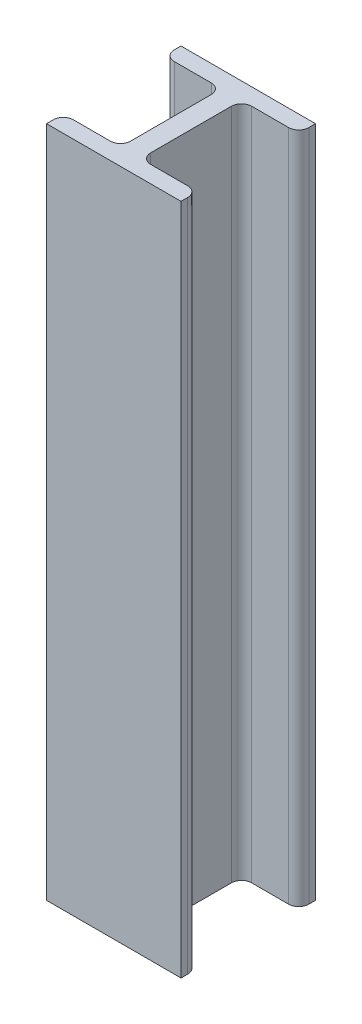
ISO-10303-21;
HEADER;
FILE_DESCRIPTION(('STEP AP214'),'2;1');
FILE_NAME('part.step','',(''),(''),'','','');
FILE_SCHEMA(('AUTOMOTIVE_DESIGN { 1 0 10303 214 1 1 1 1 }'));
ENDSEC;
DATA;
#1=APPLICATION_CONTEXT('core data for automotive mechanical design processes');
#2=APPLICATION_PROTOCOL_DEFINITION('international standard','automotive_design',2000,#1);
#3=PRODUCT_CONTEXT('',#1,'mechanical');
#4=PRODUCT('Part','Part','',(#3));
#5=PRODUCT_RELATED_PRODUCT_CATEGORY('part','',(#4));
#6=PRODUCT_DEFINITION_FORMATION('','',#4);
#7=PRODUCT_DEFINITION_CONTEXT('part definition',#1,'design');
#8=PRODUCT_DEFINITION('design','',#6,#7);
#9=PRODUCT_DEFINITION_SHAPE('','',#8);
#10=(LENGTH_UNIT() NAMED_UNIT(*) SI_UNIT(.MILLI.,.METRE.));
#11=(NAMED_UNIT(*) PLANE_ANGLE_UNIT() SI_UNIT($,.RADIAN.));
#12=(NAMED_UNIT(*) SI_UNIT($,.STERADIAN.) SOLID_ANGLE_UNIT());
#13=UNCERTAINTY_MEASURE_WITH_UNIT(LENGTH_MEASURE(1.E-05),#10,'distance_accuracy_value','');
#14=(GEOMETRIC_REPRESENTATION_CONTEXT(3) GLOBAL_UNCERTAINTY_ASSIGNED_CONTEXT((#13)) GLOBAL_UNIT_ASSIGNED_CONTEXT((#10,
#11,#12)) REPRESENTATION_CONTEXT('',''));
#15=CARTESIAN_POINT('',(0.,0.,0.));
#16=DIRECTION('',(0.,0.,1.));
#17=DIRECTION('',(1.,0.,0.));
#18=AXIS2_PLACEMENT_3D('',#15,#16,#17);
#19=CARTESIAN_POINT('',(-20.,200.,0.));
#20=DIRECTION('',(-1.,0.,0.));
#21=DIRECTION('',(0.,0.,1.));
#22=AXIS2_PLACEMENT_3D('',#19,#20,#21);
#23=PLANE('',#22);
#24=DIRECTION('',(0.,0.,-1.));
#25=VECTOR('',#24,1.);
#26=CARTESIAN_POINT('',(-20.,200.,0.));
#27=LINE('',#26,#25);
#28=CARTESIAN_POINT('',(-20.,200.,0.));
#29=VERTEX_POINT('',#28);
#30=CARTESIAN_POINT('',(-20.,200.,-2.));
#31=VERTEX_POINT('',#30);
#32=EDGE_CURVE('E179',#29,#31,#27,.T.);
#33=ORIENTED_EDGE('',*,*,#32,.T.);
#34=DIRECTION('',(0.,-1.,0.));
#35=VECTOR('',#34,1.);
#36=CARTESIAN_POINT('',(-20.,200.,-2.));
#37=LINE('',#36,#35);
#38=CARTESIAN_POINT('',(-20.,0.,-2.));
#39=VERTEX_POINT('',#38);
#40=EDGE_CURVE('E317',#31,#39,#37,.T.);
#41=ORIENTED_EDGE('',*,*,#40,.T.);
#42=DIRECTION('',(0.,0.,-1.));
#43=VECTOR('',#42,1.);
#44=CARTESIAN_POINT('',(-20.,0.,0.));
#45=LINE('',#44,#43);
#46=CARTESIAN_POINT('',(-20.,0.,0.));
#47=VERTEX_POINT('',#46);
#48=EDGE_CURVE('E182',#47,#39,#45,.T.);
#49=ORIENTED_EDGE('',*,*,#48,.F.);
#50=DIRECTION('',(0.,-1.,0.));
#51=VECTOR('',#50,1.);
#52=CARTESIAN_POINT('',(-20.,200.,0.));
#53=LINE('',#52,#51);
#54=EDGE_CURVE('E175',#29,#47,#53,.T.);
#55=ORIENTED_EDGE('',*,*,#54,.F.);
#56=EDGE_LOOP('',(#33,#41,#49,#55));
#57=FACE_BOUND('',#56,.T.);
#58=ADVANCED_FACE('F36',(#57),#23,.T.);
#59=CARTESIAN_POINT('',(0.,200.,0.));
#60=DIRECTION('',(0.,0.,-1.));
#61=DIRECTION('',(-1.,0.,0.));
#62=AXIS2_PLACEMENT_3D('',#59,#60,#61);
#63=PLANE('',#62);
#64=DIRECTION('',(1.,0.,0.));
#65=VECTOR('',#64,1.);
#66=CARTESIAN_POINT('',(0.,0.,0.));
#67=LINE('',#66,#65);
#68=CARTESIAN_POINT('',(20.,0.,0.));
#69=VERTEX_POINT('',#68);
#70=EDGE_CURVE('E229',#47,#69,#67,.T.);
#71=ORIENTED_EDGE('',*,*,#70,.T.);
#72=DIRECTION('',(0.,-1.,0.));
#73=VECTOR('',#72,1.);
#74=CARTESIAN_POINT('',(20.,200.,0.));
#75=LINE('',#74,#73);
#76=CARTESIAN_POINT('',(20.,200.,0.));
#77=VERTEX_POINT('',#76);
#78=EDGE_CURVE('E186',#77,#69,#75,.T.);
#79=ORIENTED_EDGE('',*,*,#78,.F.);
#80=DIRECTION('',(1.,0.,0.));
#81=VECTOR('',#80,1.);
#82=CARTESIAN_POINT('',(0.,200.,0.));
#83=LINE('',#82,#81);
#84=EDGE_CURVE('E189',#29,#77,#83,.T.);
#85=ORIENTED_EDGE('',*,*,#84,.F.);
#86=ORIENTED_EDGE('',*,*,#54,.T.);
#87=EDGE_LOOP('',(#71,#79,#85,#86));
#88=FACE_BOUND('',#87,.T.);
#89=ADVANCED_FACE('F190',(#88),#63,.F.);
#90=CARTESIAN_POINT('',(20.,200.,0.));
#91=DIRECTION('',(-1.,0.,0.));
#92=DIRECTION('',(0.,0.,1.));
#93=AXIS2_PLACEMENT_3D('',#90,#91,#92);
#94=PLANE('',#93);
#95=DIRECTION('',(0.,0.,-1.));
#96=VECTOR('',#95,1.);
#97=CARTESIAN_POINT('',(20.,0.,0.));
#98=LINE('',#97,#96);
#99=CARTESIAN_POINT('',(20.,0.,-2.));
#100=VERTEX_POINT('',#99);
#101=EDGE_CURVE('E231',#69,#100,#98,.T.);
#102=ORIENTED_EDGE('',*,*,#101,.T.);
#103=DIRECTION('',(0.,-1.,0.));
#104=VECTOR('',#103,1.);
#105=CARTESIAN_POINT('',(20.,200.,-2.));
#106=LINE('',#105,#104);
#107=CARTESIAN_POINT('',(20.,200.,-2.));
#108=VERTEX_POINT('',#107);
#109=EDGE_CURVE('E309',#100,#108,#106,.F.);
#110=ORIENTED_EDGE('',*,*,#109,.T.);
#111=DIRECTION('',(0.,0.,-1.));
#112=VECTOR('',#111,1.);
#113=CARTESIAN_POINT('',(20.,200.,0.));
#114=LINE('',#113,#112);
#115=EDGE_CURVE('E194',#77,#108,#114,.T.);
#116=ORIENTED_EDGE('',*,*,#115,.F.);
#117=ORIENTED_EDGE('',*,*,#78,.T.);
#118=EDGE_LOOP('',(#102,#110,#116,#117));
#119=FACE_BOUND('',#118,.T.);
#120=ADVANCED_FACE('F371',(#119),#94,.F.);
#121=CARTESIAN_POINT('',(0.,200.,-5.));
#122=DIRECTION('',(0.,0.,1.));
#123=DIRECTION('',(1.,0.,0.));
#124=AXIS2_PLACEMENT_3D('',#121,#122,#123);
#125=PLANE('',#124);
#126=DIRECTION('',(-1.,0.,0.));
#127=VECTOR('',#126,1.);
#128=CARTESIAN_POINT('',(0.,200.,-5.));
#129=LINE('',#128,#127);
#130=CARTESIAN_POINT('',(17.,200.,-5.));
#131=VERTEX_POINT('',#130);
#132=CARTESIAN_POINT('',(6.,200.,-5.));
#133=VERTEX_POINT('',#132);
#134=EDGE_CURVE('E205',#131,#133,#129,.T.);
#135=ORIENTED_EDGE('',*,*,#134,.F.);
#136=DIRECTION('',(0.,-1.,0.));
#137=VECTOR('',#136,1.);
#138=CARTESIAN_POINT('',(17.,200.,-5.));
#139=LINE('',#138,#137);
#140=CARTESIAN_POINT('',(17.,0.,-5.));
#141=VERTEX_POINT('',#140);
#142=EDGE_CURVE('E298',#131,#141,#139,.T.);
#143=ORIENTED_EDGE('',*,*,#142,.T.);
#144=DIRECTION('',(-1.,0.,0.));
#145=VECTOR('',#144,1.);
#146=CARTESIAN_POINT('',(0.,0.,-5.));
#147=LINE('',#146,#145);
#148=CARTESIAN_POINT('',(6.,0.,-5.));
#149=VERTEX_POINT('',#148);
#150=EDGE_CURVE('E234',#141,#149,#147,.T.);
#151=ORIENTED_EDGE('',*,*,#150,.T.);
#152=DIRECTION('',(0.,-1.,0.));
#153=VECTOR('',#152,1.);
#154=CARTESIAN_POINT('',(6.,200.,-5.));
#155=LINE('',#154,#153);
#156=EDGE_CURVE('E277',#149,#133,#155,.F.);
#157=ORIENTED_EDGE('',*,*,#156,.T.);
#158=EDGE_LOOP('',(#135,#143,#151,#157));
#159=FACE_BOUND('',#158,.T.);
#160=ADVANCED_FACE('F364',(#159),#125,.F.);
#161=CARTESIAN_POINT('',(3.,200.,0.));
#162=DIRECTION('',(-1.,0.,0.));
#163=DIRECTION('',(0.,0.,1.));
#164=AXIS2_PLACEMENT_3D('',#161,#162,#163);
#165=PLANE('',#164);
#166=DIRECTION('',(0.,0.,-1.));
#167=VECTOR('',#166,1.);
#168=CARTESIAN_POINT('',(3.,0.,0.));
#169=LINE('',#168,#167);
#170=CARTESIAN_POINT('',(3.,0.,-8.));
#171=VERTEX_POINT('',#170);
#172=CARTESIAN_POINT('',(3.,0.,-32.));
#173=VERTEX_POINT('',#172);
#174=EDGE_CURVE('E236',#171,#173,#169,.T.);
#175=ORIENTED_EDGE('',*,*,#174,.T.);
#176=DIRECTION('',(0.,-1.,0.));
#177=VECTOR('',#176,1.);
#178=CARTESIAN_POINT('',(3.,200.,-32.));
#179=LINE('',#178,#177);
#180=CARTESIAN_POINT('',(3.,200.,-32.));
#181=VERTEX_POINT('',#180);
#182=EDGE_CURVE('E275',#173,#181,#179,.F.);
#183=ORIENTED_EDGE('',*,*,#182,.T.);
#184=DIRECTION('',(0.,0.,-1.));
#185=VECTOR('',#184,1.);
#186=CARTESIAN_POINT('',(3.,200.,0.));
#187=LINE('',#186,#185);
#188=CARTESIAN_POINT('',(3.,200.,-8.));
#189=VERTEX_POINT('',#188);
#190=EDGE_CURVE('E207',#189,#181,#187,.T.);
#191=ORIENTED_EDGE('',*,*,#190,.F.);
#192=DIRECTION('',(0.,-1.,0.));
#193=VECTOR('',#192,1.);
#194=CARTESIAN_POINT('',(3.,0.,-8.));
#195=LINE('',#194,#193);
#196=EDGE_CURVE('E272',#189,#171,#195,.T.);
#197=ORIENTED_EDGE('',*,*,#196,.T.);
#198=EDGE_LOOP('',(#175,#183,#191,#197));
#199=FACE_BOUND('',#198,.T.);
#200=ADVANCED_FACE('F352',(#199),#165,.F.);
#201=CARTESIAN_POINT('',(0.,200.,-35.));
#202=DIRECTION('',(0.,0.,-1.));
#203=DIRECTION('',(-1.,0.,0.));
#204=AXIS2_PLACEMENT_3D('',#201,#202,#203);
#205=PLANE('',#204);
#206=DIRECTION('',(1.,0.,0.));
#207=VECTOR('',#206,1.);
#208=CARTESIAN_POINT('',(0.,0.,-35.));
#209=LINE('',#208,#207);
#210=CARTESIAN_POINT('',(6.,0.,-35.));
#211=VERTEX_POINT('',#210);
#212=CARTESIAN_POINT('',(17.,0.,-35.));
#213=VERTEX_POINT('',#212);
#214=EDGE_CURVE('E239',#211,#213,#209,.T.);
#215=ORIENTED_EDGE('',*,*,#214,.T.);
#216=DIRECTION('',(0.,-1.,0.));
#217=VECTOR('',#216,1.);
#218=CARTESIAN_POINT('',(17.,200.,-35.));
#219=LINE('',#218,#217);
#220=CARTESIAN_POINT('',(17.,200.,-35.));
#221=VERTEX_POINT('',#220);
#222=EDGE_CURVE('E11',#213,#221,#219,.F.);
#223=ORIENTED_EDGE('',*,*,#222,.T.);
#224=DIRECTION('',(1.,0.,0.));
#225=VECTOR('',#224,1.);
#226=CARTESIAN_POINT('',(0.,200.,-35.));
#227=LINE('',#226,#225);
#228=CARTESIAN_POINT('',(6.,200.,-35.));
#229=VERTEX_POINT('',#228);
#230=EDGE_CURVE('E210',#229,#221,#227,.T.);
#231=ORIENTED_EDGE('',*,*,#230,.F.);
#232=DIRECTION('',(0.,-1.,0.));
#233=VECTOR('',#232,1.);
#234=CARTESIAN_POINT('',(6.,0.,-35.));
#235=LINE('',#234,#233);
#236=EDGE_CURVE('E269',#229,#211,#235,.T.);
#237=ORIENTED_EDGE('',*,*,#236,.T.);
#238=EDGE_LOOP('',(#215,#223,#231,#237));
#239=FACE_BOUND('',#238,.T.);
#240=ADVANCED_FACE('F346',(#239),#205,.F.);
#241=CARTESIAN_POINT('',(20.,200.,0.));
#242=DIRECTION('',(-1.,0.,0.));
#243=DIRECTION('',(0.,0.,1.));
#244=AXIS2_PLACEMENT_3D('',#241,#242,#243);
#245=PLANE('',#244);
#246=DIRECTION('',(0.,0.,-1.));
#247=VECTOR('',#246,1.);
#248=CARTESIAN_POINT('',(20.,200.,0.));
#249=LINE('',#248,#247);
#250=CARTESIAN_POINT('',(20.,200.,-38.));
#251=VERTEX_POINT('',#250);
#252=CARTESIAN_POINT('',(20.,200.,-40.));
#253=VERTEX_POINT('',#252);
#254=EDGE_CURVE('E213',#251,#253,#249,.T.);
#255=ORIENTED_EDGE('',*,*,#254,.F.);
#256=DIRECTION('',(0.,-1.,0.));
#257=VECTOR('',#256,1.);
#258=CARTESIAN_POINT('',(20.,200.,-38.));
#259=LINE('',#258,#257);
#260=CARTESIAN_POINT('',(20.,0.,-38.));
#261=VERTEX_POINT('',#260);
#262=EDGE_CURVE('E44',#251,#261,#259,.T.);
#263=ORIENTED_EDGE('',*,*,#262,.T.);
#264=DIRECTION('',(0.,0.,-1.));
#265=VECTOR('',#264,1.);
#266=CARTESIAN_POINT('',(20.,0.,0.));
#267=LINE('',#266,#265);
#268=CARTESIAN_POINT('',(20.,0.,-40.));
#269=VERTEX_POINT('',#268);
#270=EDGE_CURVE('E242',#261,#269,#267,.T.);
#271=ORIENTED_EDGE('',*,*,#270,.T.);
#272=DIRECTION('',(0.,-1.,0.));
#273=VECTOR('',#272,1.);
#274=CARTESIAN_POINT('',(20.,200.,-40.));
#275=LINE('',#274,#273);
#276=EDGE_CURVE('E256',#253,#269,#275,.T.);
#277=ORIENTED_EDGE('',*,*,#276,.F.);
#278=EDGE_LOOP('',(#255,#263,#271,#277));
#279=FACE_BOUND('',#278,.T.);
#280=ADVANCED_FACE('F329',(#279),#245,.F.);
#281=CARTESIAN_POINT('',(0.,200.,-40.));
#282=DIRECTION('',(0.,0.,1.));
#283=DIRECTION('',(1.,0.,0.));
#284=AXIS2_PLACEMENT_3D('',#281,#282,#283);
#285=PLANE('',#284);
#286=DIRECTION('',(-1.,0.,0.));
#287=VECTOR('',#286,1.);
#288=CARTESIAN_POINT('',(0.,0.,-40.));
#289=LINE('',#288,#287);
#290=CARTESIAN_POINT('',(-20.,0.,-40.));
#291=VERTEX_POINT('',#290);
#292=EDGE_CURVE('E244',#269,#291,#289,.T.);
#293=ORIENTED_EDGE('',*,*,#292,.T.);
#294=DIRECTION('',(0.,-1.,0.));
#295=VECTOR('',#294,1.);
#296=CARTESIAN_POINT('',(-20.,200.,-40.));
#297=LINE('',#296,#295);
#298=CARTESIAN_POINT('',(-20.,200.,-40.));
#299=VERTEX_POINT('',#298);
#300=EDGE_CURVE('E227',#299,#291,#297,.T.);
#301=ORIENTED_EDGE('',*,*,#300,.F.);
#302=DIRECTION('',(-1.,0.,0.));
#303=VECTOR('',#302,1.);
#304=CARTESIAN_POINT('',(0.,200.,-40.));
#305=LINE('',#304,#303);
#306=EDGE_CURVE('E215',#253,#299,#305,.T.);
#307=ORIENTED_EDGE('',*,*,#306,.F.);
#308=ORIENTED_EDGE('',*,*,#276,.T.);
#309=EDGE_LOOP('',(#293,#301,#307,#308));
#310=FACE_BOUND('',#309,.T.);
#311=ADVANCED_FACE('F341',(#310),#285,.F.);
#312=CARTESIAN_POINT('',(-19.9999999999999,200.,0.));
#313=DIRECTION('',(-1.,0.,0.));
#314=DIRECTION('',(0.,0.,1.));
#315=AXIS2_PLACEMENT_3D('',#312,#313,#314);
#316=PLANE('',#315);
#317=DIRECTION('',(0.,0.,-1.));
#318=VECTOR('',#317,1.);
#319=CARTESIAN_POINT('',(-19.9999999999999,0.,0.));
#320=LINE('',#319,#318);
#321=CARTESIAN_POINT('',(-20.,0.,-38.));
#322=VERTEX_POINT('',#321);
#323=EDGE_CURVE('E247',#322,#291,#320,.T.);
#324=ORIENTED_EDGE('',*,*,#323,.F.);
#325=DIRECTION('',(0.,-1.,0.));
#326=VECTOR('',#325,1.);
#327=CARTESIAN_POINT('',(-20.,200.,-38.));
#328=LINE('',#327,#326);
#329=CARTESIAN_POINT('',(-20.,200.,-38.));
#330=VERTEX_POINT('',#329);
#331=EDGE_CURVE('E323',#322,#330,#328,.F.);
#332=ORIENTED_EDGE('',*,*,#331,.T.);
#333=DIRECTION('',(0.,0.,-1.));
#334=VECTOR('',#333,1.);
#335=CARTESIAN_POINT('',(-19.9999999999999,200.,0.));
#336=LINE('',#335,#334);
#337=EDGE_CURVE('E218',#330,#299,#336,.T.);
#338=ORIENTED_EDGE('',*,*,#337,.T.);
#339=ORIENTED_EDGE('',*,*,#300,.T.);
#340=EDGE_LOOP('',(#324,#332,#338,#339));
#341=FACE_BOUND('',#340,.T.);
#342=ADVANCED_FACE('F470',(#341),#316,.T.);
#343=CARTESIAN_POINT('',(0.,200.,-35.));
#344=DIRECTION('',(0.,0.,1.));
#345=DIRECTION('',(1.,0.,0.));
#346=AXIS2_PLACEMENT_3D('',#343,#344,#345);
#347=PLANE('',#346);
#348=DIRECTION('',(-1.,0.,0.));
#349=VECTOR('',#348,1.);
#350=CARTESIAN_POINT('',(0.,200.,-35.));
#351=LINE('',#350,#349);
#352=CARTESIAN_POINT('',(-6.,200.,-35.));
#353=VERTEX_POINT('',#352);
#354=CARTESIAN_POINT('',(-17.,200.,-35.));
#355=VERTEX_POINT('',#354);
#356=EDGE_CURVE('E220',#353,#355,#351,.T.);
#357=ORIENTED_EDGE('',*,*,#356,.T.);
#358=DIRECTION('',(0.,-1.,0.));
#359=VECTOR('',#358,1.);
#360=CARTESIAN_POINT('',(-17.,200.,-35.));
#361=LINE('',#360,#359);
#362=CARTESIAN_POINT('',(-17.,0.,-35.));
#363=VERTEX_POINT('',#362);
#364=EDGE_CURVE('E320',#355,#363,#361,.T.);
#365=ORIENTED_EDGE('',*,*,#364,.T.);
#366=DIRECTION('',(-1.,0.,0.));
#367=VECTOR('',#366,1.);
#368=CARTESIAN_POINT('',(0.,0.,-35.));
#369=LINE('',#368,#367);
#370=CARTESIAN_POINT('',(-6.,0.,-35.));
#371=VERTEX_POINT('',#370);
#372=EDGE_CURVE('E249',#371,#363,#369,.T.);
#373=ORIENTED_EDGE('',*,*,#372,.F.);
#374=DIRECTION('',(0.,-1.,0.));
#375=VECTOR('',#374,1.);
#376=CARTESIAN_POINT('',(-6.,200.,-35.));
#377=LINE('',#376,#375);
#378=EDGE_CURVE('E267',#371,#353,#377,.F.);
#379=ORIENTED_EDGE('',*,*,#378,.T.);
#380=EDGE_LOOP('',(#357,#365,#373,#379));
#381=FACE_BOUND('',#380,.T.);
#382=ADVANCED_FACE('F465',(#381),#347,.T.);
#383=CARTESIAN_POINT('',(-2.99999999999999,200.,0.));
#384=DIRECTION('',(-1.,0.,0.));
#385=DIRECTION('',(0.,0.,1.));
#386=AXIS2_PLACEMENT_3D('',#383,#384,#385);
#387=PLANE('',#386);
#388=DIRECTION('',(0.,0.,-1.));
#389=VECTOR('',#388,1.);
#390=CARTESIAN_POINT('',(-2.99999999999999,0.,0.));
#391=LINE('',#390,#389);
#392=CARTESIAN_POINT('',(-2.99999999999999,0.,-8.));
#393=VERTEX_POINT('',#392);
#394=CARTESIAN_POINT('',(-3.,0.,-32.));
#395=VERTEX_POINT('',#394);
#396=EDGE_CURVE('E201',#393,#395,#391,.T.);
#397=ORIENTED_EDGE('',*,*,#396,.F.);
#398=DIRECTION('',(0.,-1.,0.));
#399=VECTOR('',#398,1.);
#400=CARTESIAN_POINT('',(-2.99999999999999,200.,-8.));
#401=LINE('',#400,#399);
#402=CARTESIAN_POINT('',(-2.99999999999999,200.,-8.));
#403=VERTEX_POINT('',#402);
#404=EDGE_CURVE('E265',#393,#403,#401,.F.);
#405=ORIENTED_EDGE('',*,*,#404,.T.);
#406=DIRECTION('',(0.,0.,-1.));
#407=VECTOR('',#406,1.);
#408=CARTESIAN_POINT('',(-2.99999999999999,200.,0.));
#409=LINE('',#408,#407);
#410=CARTESIAN_POINT('',(-3.,200.,-32.));
#411=VERTEX_POINT('',#410);
#412=EDGE_CURVE('E222',#403,#411,#409,.T.);
#413=ORIENTED_EDGE('',*,*,#412,.T.);
#414=DIRECTION('',(0.,-1.,0.));
#415=VECTOR('',#414,1.);
#416=CARTESIAN_POINT('',(-3.,0.,-32.));
#417=LINE('',#416,#415);
#418=EDGE_CURVE('E262',#411,#395,#417,.T.);
#419=ORIENTED_EDGE('',*,*,#418,.T.);
#420=EDGE_LOOP('',(#397,#405,#413,#419));
#421=FACE_BOUND('',#420,.T.);
#422=ADVANCED_FACE('F458',(#421),#387,.T.);
#423=CARTESIAN_POINT('',(0.,200.,-5.));
#424=DIRECTION('',(0.,0.,-1.));
#425=DIRECTION('',(-1.,0.,0.));
#426=AXIS2_PLACEMENT_3D('',#423,#424,#425);
#427=PLANE('',#426);
#428=DIRECTION('',(1.,0.,0.));
#429=VECTOR('',#428,1.);
#430=CARTESIAN_POINT('',(0.,0.,-5.));
#431=LINE('',#430,#429);
#432=CARTESIAN_POINT('',(-17.,0.,-5.));
#433=VERTEX_POINT('',#432);
#434=CARTESIAN_POINT('',(-5.99999999999999,0.,-5.));
#435=VERTEX_POINT('',#434);
#436=EDGE_CURVE('E199',#433,#435,#431,.T.);
#437=ORIENTED_EDGE('',*,*,#436,.F.);
#438=DIRECTION('',(0.,-1.,0.));
#439=VECTOR('',#438,1.);
#440=CARTESIAN_POINT('',(-17.,200.,-5.));
#441=LINE('',#440,#439);
#442=CARTESIAN_POINT('',(-17.,200.,-5.));
#443=VERTEX_POINT('',#442);
#444=EDGE_CURVE('E51',#433,#443,#441,.F.);
#445=ORIENTED_EDGE('',*,*,#444,.T.);
#446=DIRECTION('',(1.,0.,0.));
#447=VECTOR('',#446,1.);
#448=CARTESIAN_POINT('',(0.,200.,-5.));
#449=LINE('',#448,#447);
#450=CARTESIAN_POINT('',(-5.99999999999999,200.,-5.));
#451=VERTEX_POINT('',#450);
#452=EDGE_CURVE('E225',#443,#451,#449,.T.);
#453=ORIENTED_EDGE('',*,*,#452,.T.);
#454=DIRECTION('',(0.,-1.,0.));
#455=VECTOR('',#454,1.);
#456=CARTESIAN_POINT('',(-5.99999999999999,0.,-5.));
#457=LINE('',#456,#455);
#458=EDGE_CURVE('E185',#451,#435,#457,.T.);
#459=ORIENTED_EDGE('',*,*,#458,.T.);
#460=EDGE_LOOP('',(#437,#445,#453,#459));
#461=FACE_BOUND('',#460,.T.);
#462=ADVANCED_FACE('F374',(#461),#427,.T.);
#463=CARTESIAN_POINT('',(0.,200.,0.));
#464=DIRECTION('',(0.,1.,0.));
#465=DIRECTION('',(0.,0.,1.));
#466=AXIS2_PLACEMENT_3D('',#463,#464,#465);
#467=PLANE('',#466);
#468=ORIENTED_EDGE('',*,*,#115,.T.);
#469=CARTESIAN_POINT('',(17.,200.,-2.));
#470=DIRECTION('',(0.,1.,0.));
#471=DIRECTION('',(0.,0.,1.));
#472=AXIS2_PLACEMENT_3D('',#469,#470,#471);
#473=CIRCLE('',#472,3.);
#474=EDGE_CURVE('E315',#108,#131,#473,.T.);
#475=ORIENTED_EDGE('',*,*,#474,.T.);
#476=ORIENTED_EDGE('',*,*,#134,.T.);
#477=CARTESIAN_POINT('',(6.,200.,-8.));
#478=DIRECTION('',(0.,1.,0.));
#479=DIRECTION('',(0.,0.,1.));
#480=AXIS2_PLACEMENT_3D('',#477,#478,#479);
#481=CIRCLE('',#480,3.);
#482=EDGE_CURVE('E296',#133,#189,#481,.F.);
#483=ORIENTED_EDGE('',*,*,#482,.T.);
#484=ORIENTED_EDGE('',*,*,#190,.T.);
#485=CARTESIAN_POINT('',(6.,200.,-32.));
#486=DIRECTION('',(0.,1.,0.));
#487=DIRECTION('',(0.,0.,1.));
#488=AXIS2_PLACEMENT_3D('',#485,#486,#487);
#489=CIRCLE('',#488,3.);
#490=EDGE_CURVE('E291',#181,#229,#489,.F.);
#491=ORIENTED_EDGE('',*,*,#490,.T.);
#492=ORIENTED_EDGE('',*,*,#230,.T.);
#493=CARTESIAN_POINT('',(17.,200.,-38.));
#494=DIRECTION('',(0.,1.,0.));
#495=DIRECTION('',(0.,0.,1.));
#496=AXIS2_PLACEMENT_3D('',#493,#494,#495);
#497=CIRCLE('',#496,3.);
#498=EDGE_CURVE('E311',#221,#251,#497,.T.);
#499=ORIENTED_EDGE('',*,*,#498,.T.);
#500=ORIENTED_EDGE('',*,*,#254,.T.);
#501=ORIENTED_EDGE('',*,*,#306,.T.);
#502=ORIENTED_EDGE('',*,*,#337,.F.);
#503=CARTESIAN_POINT('',(-17.,200.,-38.));
#504=DIRECTION('',(0.,1.,0.));
#505=DIRECTION('',(0.,0.,1.));
#506=AXIS2_PLACEMENT_3D('',#503,#504,#505);
#507=CIRCLE('',#506,3.);
#508=EDGE_CURVE('E59',#330,#355,#507,.T.);
#509=ORIENTED_EDGE('',*,*,#508,.T.);
#510=ORIENTED_EDGE('',*,*,#356,.F.);
#511=CARTESIAN_POINT('',(-6.,200.,-32.));
#512=DIRECTION('',(0.,1.,0.));
#513=DIRECTION('',(0.,0.,1.));
#514=AXIS2_PLACEMENT_3D('',#511,#512,#513);
#515=CIRCLE('',#514,3.);
#516=EDGE_CURVE('E287',#353,#411,#515,.F.);
#517=ORIENTED_EDGE('',*,*,#516,.T.);
#518=ORIENTED_EDGE('',*,*,#412,.F.);
#519=CARTESIAN_POINT('',(-5.99999999999999,200.,-8.));
#520=DIRECTION('',(0.,1.,0.));
#521=DIRECTION('',(0.,0.,1.));
#522=AXIS2_PLACEMENT_3D('',#519,#520,#521);
#523=CIRCLE('',#522,3.);
#524=EDGE_CURVE('E282',#403,#451,#523,.F.);
#525=ORIENTED_EDGE('',*,*,#524,.T.);
#526=ORIENTED_EDGE('',*,*,#452,.F.);
#527=CARTESIAN_POINT('',(-17.,200.,-2.));
#528=DIRECTION('',(0.,1.,0.));
#529=DIRECTION('',(0.,0.,1.));
#530=AXIS2_PLACEMENT_3D('',#527,#528,#529);
#531=CIRCLE('',#530,3.);
#532=EDGE_CURVE('E198',#443,#31,#531,.T.);
#533=ORIENTED_EDGE('',*,*,#532,.T.);
#534=ORIENTED_EDGE('',*,*,#32,.F.);
#535=ORIENTED_EDGE('',*,*,#84,.T.);
#536=EDGE_LOOP('',(#468,#475,#476,#483,#484,#491,#492,#499,#500,#501,#502,#509,#510,#517,#518,
#525,#526,#533,#534,#535));
#537=FACE_BOUND('',#536,.T.);
#538=ADVANCED_FACE('F196',(#537),#467,.T.);
#539=CARTESIAN_POINT('',(0.,0.,0.));
#540=DIRECTION('',(0.,1.,0.));
#541=DIRECTION('',(0.,0.,1.));
#542=AXIS2_PLACEMENT_3D('',#539,#540,#541);
#543=PLANE('',#542);
#544=ORIENTED_EDGE('',*,*,#150,.F.);
#545=CARTESIAN_POINT('',(17.,0.,-2.));
#546=DIRECTION('',(0.,1.,0.));
#547=DIRECTION('',(0.,0.,1.));
#548=AXIS2_PLACEMENT_3D('',#545,#546,#547);
#549=CIRCLE('',#548,3.);
#550=EDGE_CURVE('E307',#141,#100,#549,.F.);
#551=ORIENTED_EDGE('',*,*,#550,.T.);
#552=ORIENTED_EDGE('',*,*,#101,.F.);
#553=ORIENTED_EDGE('',*,*,#70,.F.);
#554=ORIENTED_EDGE('',*,*,#48,.T.);
#555=CARTESIAN_POINT('',(-17.,0.,-2.));
#556=DIRECTION('',(0.,1.,0.));
#557=DIRECTION('',(0.,0.,1.));
#558=AXIS2_PLACEMENT_3D('',#555,#556,#557);
#559=CIRCLE('',#558,3.);
#560=EDGE_CURVE('E305',#39,#433,#559,.F.);
#561=ORIENTED_EDGE('',*,*,#560,.T.);
#562=ORIENTED_EDGE('',*,*,#436,.T.);
#563=CARTESIAN_POINT('',(-5.99999999999999,0.,-8.));
#564=DIRECTION('',(0.,1.,0.));
#565=DIRECTION('',(0.,0.,1.));
#566=AXIS2_PLACEMENT_3D('',#563,#564,#565);
#567=CIRCLE('',#566,3.);
#568=EDGE_CURVE('E280',#435,#393,#567,.T.);
#569=ORIENTED_EDGE('',*,*,#568,.T.);
#570=ORIENTED_EDGE('',*,*,#396,.T.);
#571=CARTESIAN_POINT('',(-6.,0.,-32.));
#572=DIRECTION('',(0.,1.,0.));
#573=DIRECTION('',(0.,0.,1.));
#574=AXIS2_PLACEMENT_3D('',#571,#572,#573);
#575=CIRCLE('',#574,3.);
#576=EDGE_CURVE('E285',#395,#371,#575,.T.);
#577=ORIENTED_EDGE('',*,*,#576,.T.);
#578=ORIENTED_EDGE('',*,*,#372,.T.);
#579=CARTESIAN_POINT('',(-17.,0.,-38.));
#580=DIRECTION('',(0.,1.,0.));
#581=DIRECTION('',(0.,0.,1.));
#582=AXIS2_PLACEMENT_3D('',#579,#580,#581);
#583=CIRCLE('',#582,3.);
#584=EDGE_CURVE('E303',#363,#322,#583,.F.);
#585=ORIENTED_EDGE('',*,*,#584,.T.);
#586=ORIENTED_EDGE('',*,*,#323,.T.);
#587=ORIENTED_EDGE('',*,*,#292,.F.);
#588=ORIENTED_EDGE('',*,*,#270,.F.);
#589=CARTESIAN_POINT('',(17.,0.,-38.));
#590=DIRECTION('',(0.,1.,0.));
#591=DIRECTION('',(0.,0.,1.));
#592=AXIS2_PLACEMENT_3D('',#589,#590,#591);
#593=CIRCLE('',#592,3.);
#594=EDGE_CURVE('E301',#261,#213,#593,.F.);
#595=ORIENTED_EDGE('',*,*,#594,.T.);
#596=ORIENTED_EDGE('',*,*,#214,.F.);
#597=CARTESIAN_POINT('',(6.,0.,-32.));
#598=DIRECTION('',(0.,1.,0.));
#599=DIRECTION('',(0.,0.,1.));
#600=AXIS2_PLACEMENT_3D('',#597,#598,#599);
#601=CIRCLE('',#600,3.);
#602=EDGE_CURVE('E289',#211,#173,#601,.T.);
#603=ORIENTED_EDGE('',*,*,#602,.T.);
#604=ORIENTED_EDGE('',*,*,#174,.F.);
#605=CARTESIAN_POINT('',(6.,0.,-8.));
#606=DIRECTION('',(0.,1.,0.));
#607=DIRECTION('',(0.,0.,1.));
#608=AXIS2_PLACEMENT_3D('',#605,#606,#607);
#609=CIRCLE('',#608,3.);
#610=EDGE_CURVE('E293',#171,#149,#609,.T.);
#611=ORIENTED_EDGE('',*,*,#610,.T.);
#612=EDGE_LOOP('',(#544,#551,#552,#553,#554,#561,#562,#569,#570,#577,#578,#585,#586,#587,#588,
#595,#596,#603,#604,#611));
#613=FACE_BOUND('',#612,.T.);
#614=ADVANCED_FACE('F336',(#613),#543,.F.);
#615=CARTESIAN_POINT('',(-5.99999999999999,200.,-8.));
#616=DIRECTION('',(0.,1.,0.));
#617=DIRECTION('',(0.,0.,1.));
#618=AXIS2_PLACEMENT_3D('',#615,#616,#617);
#619=CYLINDRICAL_SURFACE('',#618,3.);
#620=ORIENTED_EDGE('',*,*,#524,.F.);
#621=ORIENTED_EDGE('',*,*,#404,.F.);
#622=ORIENTED_EDGE('',*,*,#568,.F.);
#623=ORIENTED_EDGE('',*,*,#458,.F.);
#624=EDGE_LOOP('',(#620,#621,#622,#623));
#625=FACE_BOUND('',#624,.T.);
#626=ADVANCED_FACE('F394',(#625),#619,.F.);
#627=CARTESIAN_POINT('',(-6.,200.,-32.));
#628=DIRECTION('',(0.,1.,0.));
#629=DIRECTION('',(0.,0.,1.));
#630=AXIS2_PLACEMENT_3D('',#627,#628,#629);
#631=CYLINDRICAL_SURFACE('',#630,3.);
#632=ORIENTED_EDGE('',*,*,#516,.F.);
#633=ORIENTED_EDGE('',*,*,#378,.F.);
#634=ORIENTED_EDGE('',*,*,#576,.F.);
#635=ORIENTED_EDGE('',*,*,#418,.F.);
#636=EDGE_LOOP('',(#632,#633,#634,#635));
#637=FACE_BOUND('',#636,.T.);
#638=ADVANCED_FACE('F397',(#637),#631,.F.);
#639=CARTESIAN_POINT('',(6.,200.,-32.));
#640=DIRECTION('',(0.,1.,0.));
#641=DIRECTION('',(0.,0.,1.));
#642=AXIS2_PLACEMENT_3D('',#639,#640,#641);
#643=CYLINDRICAL_SURFACE('',#642,3.);
#644=ORIENTED_EDGE('',*,*,#490,.F.);
#645=ORIENTED_EDGE('',*,*,#182,.F.);
#646=ORIENTED_EDGE('',*,*,#602,.F.);
#647=ORIENTED_EDGE('',*,*,#236,.F.);
#648=EDGE_LOOP('',(#644,#645,#646,#647));
#649=FACE_BOUND('',#648,.T.);
#650=ADVANCED_FACE('F356',(#649),#643,.F.);
#651=CARTESIAN_POINT('',(6.,200.,-8.));
#652=DIRECTION('',(0.,1.,0.));
#653=DIRECTION('',(0.,0.,1.));
#654=AXIS2_PLACEMENT_3D('',#651,#652,#653);
#655=CYLINDRICAL_SURFACE('',#654,3.);
#656=ORIENTED_EDGE('',*,*,#482,.F.);
#657=ORIENTED_EDGE('',*,*,#156,.F.);
#658=ORIENTED_EDGE('',*,*,#610,.F.);
#659=ORIENTED_EDGE('',*,*,#196,.F.);
#660=EDGE_LOOP('',(#656,#657,#658,#659));
#661=FACE_BOUND('',#660,.T.);
#662=ADVANCED_FACE('F359',(#661),#655,.F.);
#663=CARTESIAN_POINT('',(17.,200.,-2.));
#664=DIRECTION('',(0.,-1.,0.));
#665=DIRECTION('',(0.,0.,-1.));
#666=AXIS2_PLACEMENT_3D('',#663,#664,#665);
#667=CYLINDRICAL_SURFACE('',#666,3.);
#668=ORIENTED_EDGE('',*,*,#474,.F.);
#669=ORIENTED_EDGE('',*,*,#109,.F.);
#670=ORIENTED_EDGE('',*,*,#550,.F.);
#671=ORIENTED_EDGE('',*,*,#142,.F.);
#672=EDGE_LOOP('',(#668,#669,#670,#671));
#673=FACE_BOUND('',#672,.T.);
#674=ADVANCED_FACE('F368',(#673),#667,.T.);
#675=CARTESIAN_POINT('',(-17.,200.,-2.));
#676=DIRECTION('',(0.,-1.,0.));
#677=DIRECTION('',(0.,0.,-1.));
#678=AXIS2_PLACEMENT_3D('',#675,#676,#677);
#679=CYLINDRICAL_SURFACE('',#678,3.);
#680=ORIENTED_EDGE('',*,*,#532,.F.);
#681=ORIENTED_EDGE('',*,*,#444,.F.);
#682=ORIENTED_EDGE('',*,*,#560,.F.);
#683=ORIENTED_EDGE('',*,*,#40,.F.);
#684=EDGE_LOOP('',(#680,#681,#682,#683));
#685=FACE_BOUND('',#684,.T.);
#686=ADVANCED_FACE('F376',(#685),#679,.T.);
#687=CARTESIAN_POINT('',(-17.,200.,-38.));
#688=DIRECTION('',(0.,-1.,0.));
#689=DIRECTION('',(0.,0.,-1.));
#690=AXIS2_PLACEMENT_3D('',#687,#688,#689);
#691=CYLINDRICAL_SURFACE('',#690,3.);
#692=ORIENTED_EDGE('',*,*,#508,.F.);
#693=ORIENTED_EDGE('',*,*,#331,.F.);
#694=ORIENTED_EDGE('',*,*,#584,.F.);
#695=ORIENTED_EDGE('',*,*,#364,.F.);
#696=EDGE_LOOP('',(#692,#693,#694,#695));
#697=FACE_BOUND('',#696,.T.);
#698=ADVANCED_FACE('F378',(#697),#691,.T.);
#699=CARTESIAN_POINT('',(17.,200.,-38.));
#700=DIRECTION('',(0.,-1.,0.));
#701=DIRECTION('',(0.,0.,-1.));
#702=AXIS2_PLACEMENT_3D('',#699,#700,#701);
#703=CYLINDRICAL_SURFACE('',#702,3.);
#704=ORIENTED_EDGE('',*,*,#498,.F.);
#705=ORIENTED_EDGE('',*,*,#222,.F.);
#706=ORIENTED_EDGE('',*,*,#594,.F.);
#707=ORIENTED_EDGE('',*,*,#262,.F.);
#708=EDGE_LOOP('',(#704,#705,#706,#707));
#709=FACE_BOUND('',#708,.T.);
#710=ADVANCED_FACE('F38',(#709),#703,.T.);
#711=CLOSED_SHELL('',(#58,#89,#120,#160,#200,#240,#280,#311,#342,#382,#422,#462,#538,#614,#626,
#638,#650,#662,#674,#686,#698,#710));
#712=MANIFOLD_SOLID_BREP('B2',#711);
#713=ADVANCED_BREP_SHAPE_REPRESENTATION('',(#18,#712),#14);
#714=SHAPE_DEFINITION_REPRESENTATION(#9,#713);
ENDSEC;
END-ISO-10303-21;
